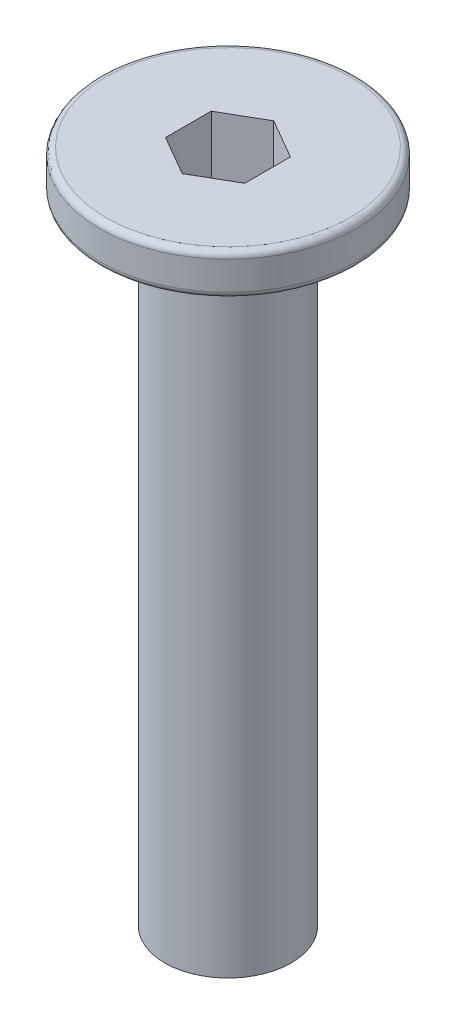
ISO-10303-21;
HEADER;
FILE_DESCRIPTION(('STEP AP214'),'2;1');
FILE_NAME('part.step','',(''),(''),'','','');
FILE_SCHEMA(('AUTOMOTIVE_DESIGN { 1 0 10303 214 1 1 1 1 }'));
ENDSEC;
DATA;
#1=APPLICATION_CONTEXT('core data for automotive mechanical design processes');
#2=APPLICATION_PROTOCOL_DEFINITION('international standard','automotive_design',2000,#1);
#3=PRODUCT_CONTEXT('',#1,'mechanical');
#4=PRODUCT('Part','Part','',(#3));
#5=PRODUCT_RELATED_PRODUCT_CATEGORY('part','',(#4));
#6=PRODUCT_DEFINITION_FORMATION('','',#4);
#7=PRODUCT_DEFINITION_CONTEXT('part definition',#1,'design');
#8=PRODUCT_DEFINITION('design','',#6,#7);
#9=PRODUCT_DEFINITION_SHAPE('','',#8);
#10=(LENGTH_UNIT() NAMED_UNIT(*) SI_UNIT(.MILLI.,.METRE.));
#11=(NAMED_UNIT(*) PLANE_ANGLE_UNIT() SI_UNIT($,.RADIAN.));
#12=(NAMED_UNIT(*) SI_UNIT($,.STERADIAN.) SOLID_ANGLE_UNIT());
#13=UNCERTAINTY_MEASURE_WITH_UNIT(LENGTH_MEASURE(1.E-05),#10,'distance_accuracy_value','');
#14=(GEOMETRIC_REPRESENTATION_CONTEXT(3) GLOBAL_UNCERTAINTY_ASSIGNED_CONTEXT((#13)) GLOBAL_UNIT_ASSIGNED_CONTEXT((#10,
#11,#12)) REPRESENTATION_CONTEXT('',''));
#15=CARTESIAN_POINT('',(0.,0.,0.));
#16=DIRECTION('',(0.,0.,1.));
#17=DIRECTION('',(1.,0.,0.));
#18=AXIS2_PLACEMENT_3D('',#15,#16,#17);
#19=CARTESIAN_POINT('',(0.,1.3,0.));
#20=DIRECTION('',(0.,-1.,0.));
#21=DIRECTION('',(0.,0.,-1.));
#22=AXIS2_PLACEMENT_3D('',#19,#20,#21);
#23=CYLINDRICAL_SURFACE('',#22,4.05);
#24=CARTESIAN_POINT('',(0.,0.2,0.));
#25=DIRECTION('',(0.,1.,0.));
#26=DIRECTION('',(0.,0.,1.));
#27=AXIS2_PLACEMENT_3D('',#24,#25,#26);
#28=CIRCLE('',#27,4.05);
#29=CARTESIAN_POINT('',(0.,0.2,4.05));
#30=VERTEX_POINT('',#29);
#31=EDGE_CURVE('E146',#30,#30,#28,.T.);
#32=ORIENTED_EDGE('',*,*,#31,.T.);
#33=EDGE_LOOP('',(#32));
#34=FACE_BOUND('',#33,.T.);
#35=CARTESIAN_POINT('',(0.,1.1,0.));
#36=DIRECTION('',(0.,1.,0.));
#37=DIRECTION('',(0.,0.,1.));
#38=AXIS2_PLACEMENT_3D('',#35,#36,#37);
#39=CIRCLE('',#38,4.05);
#40=CARTESIAN_POINT('',(0.,1.1,4.05));
#41=VERTEX_POINT('',#40);
#42=EDGE_CURVE('E143',#41,#41,#39,.F.);
#43=ORIENTED_EDGE('',*,*,#42,.T.);
#44=EDGE_LOOP('',(#43));
#45=FACE_BOUND('',#44,.T.);
#46=ADVANCED_FACE('F33',(#34,#45),#23,.T.);
#47=CARTESIAN_POINT('',(0.,1.3,0.));
#48=DIRECTION('',(0.,1.,0.));
#49=DIRECTION('',(0.,0.,1.));
#50=AXIS2_PLACEMENT_3D('',#47,#48,#49);
#51=PLANE('',#50);
#52=DIRECTION('',(0.,0.,1.));
#53=VECTOR('',#52,1.);
#54=CARTESIAN_POINT('',(-1.25,1.3,-0.721687836487032));
#55=LINE('',#54,#53);
#56=CARTESIAN_POINT('',(-1.25,1.3,-0.721687836487032));
#57=VERTEX_POINT('',#56);
#58=CARTESIAN_POINT('',(-1.25,1.3,0.721687836487032));
#59=VERTEX_POINT('',#58);
#60=EDGE_CURVE('E48',#57,#59,#55,.T.);
#61=ORIENTED_EDGE('',*,*,#60,.F.);
#62=DIRECTION('',(-0.866025403784438,0.,0.5));
#63=VECTOR('',#62,1.);
#64=CARTESIAN_POINT('',(0.,1.3,-1.44337567297406));
#65=LINE('',#64,#63);
#66=CARTESIAN_POINT('',(0.,1.3,-1.44337567297406));
#67=VERTEX_POINT('',#66);
#68=EDGE_CURVE('E131',#67,#57,#65,.T.);
#69=ORIENTED_EDGE('',*,*,#68,.F.);
#70=DIRECTION('',(-0.866025403784439,0.,-0.5));
#71=VECTOR('',#70,1.);
#72=CARTESIAN_POINT('',(1.25,1.3,-0.721687836487032));
#73=LINE('',#72,#71);
#74=CARTESIAN_POINT('',(1.25,1.3,-0.721687836487032));
#75=VERTEX_POINT('',#74);
#76=EDGE_CURVE('E129',#75,#67,#73,.T.);
#77=ORIENTED_EDGE('',*,*,#76,.F.);
#78=DIRECTION('',(0.,0.,-1.));
#79=VECTOR('',#78,1.);
#80=CARTESIAN_POINT('',(1.25,1.3,0.721687836487032));
#81=LINE('',#80,#79);
#82=CARTESIAN_POINT('',(1.25,1.3,0.721687836487032));
#83=VERTEX_POINT('',#82);
#84=EDGE_CURVE('E96',#83,#75,#81,.T.);
#85=ORIENTED_EDGE('',*,*,#84,.F.);
#86=DIRECTION('',(0.866025403784438,0.,-0.5));
#87=VECTOR('',#86,1.);
#88=CARTESIAN_POINT('',(0.,1.3,1.44337567297406));
#89=LINE('',#88,#87);
#90=CARTESIAN_POINT('',(0.,1.3,1.44337567297406));
#91=VERTEX_POINT('',#90);
#92=EDGE_CURVE('E125',#91,#83,#89,.T.);
#93=ORIENTED_EDGE('',*,*,#92,.F.);
#94=DIRECTION('',(0.866025403784439,0.,0.5));
#95=VECTOR('',#94,1.);
#96=CARTESIAN_POINT('',(-1.25,1.3,0.721687836487032));
#97=LINE('',#96,#95);
#98=EDGE_CURVE('E122',#59,#91,#97,.T.);
#99=ORIENTED_EDGE('',*,*,#98,.F.);
#100=EDGE_LOOP('',(#61,#69,#77,#85,#93,#99));
#101=FACE_BOUND('',#100,.T.);
#102=CARTESIAN_POINT('',(0.,1.3,0.));
#103=DIRECTION('',(0.,1.,0.));
#104=DIRECTION('',(0.,0.,1.));
#105=AXIS2_PLACEMENT_3D('',#102,#103,#104);
#106=CIRCLE('',#105,3.85);
#107=CARTESIAN_POINT('',(0.,1.3,3.85));
#108=VERTEX_POINT('',#107);
#109=EDGE_CURVE('E41',#108,#108,#106,.T.);
#110=ORIENTED_EDGE('',*,*,#109,.T.);
#111=EDGE_LOOP('',(#110));
#112=FACE_BOUND('',#111,.T.);
#113=ADVANCED_FACE('F154',(#101,#112),#51,.T.);
#114=CARTESIAN_POINT('',(0.,0.,0.));
#115=DIRECTION('',(0.,1.,0.));
#116=DIRECTION('',(0.,0.,1.));
#117=AXIS2_PLACEMENT_3D('',#114,#115,#116);
#118=PLANE('',#117);
#119=CARTESIAN_POINT('',(0.,0.,0.));
#120=DIRECTION('',(0.,1.,0.));
#121=DIRECTION('',(0.,0.,1.));
#122=AXIS2_PLACEMENT_3D('',#119,#120,#121);
#123=CIRCLE('',#122,2.);
#124=CARTESIAN_POINT('',(0.,0.,2.));
#125=VERTEX_POINT('',#124);
#126=EDGE_CURVE('E11',#125,#125,#123,.F.);
#127=ORIENTED_EDGE('',*,*,#126,.F.);
#128=EDGE_LOOP('',(#127));
#129=FACE_BOUND('',#128,.T.);
#130=CARTESIAN_POINT('',(0.,0.,0.));
#131=DIRECTION('',(0.,1.,0.));
#132=DIRECTION('',(0.,0.,1.));
#133=AXIS2_PLACEMENT_3D('',#130,#131,#132);
#134=CIRCLE('',#133,3.85);
#135=CARTESIAN_POINT('',(0.,0.,3.85));
#136=VERTEX_POINT('',#135);
#137=EDGE_CURVE('E149',#136,#136,#134,.F.);
#138=ORIENTED_EDGE('',*,*,#137,.T.);
#139=EDGE_LOOP('',(#138));
#140=FACE_BOUND('',#139,.T.);
#141=ADVANCED_FACE('F167',(#129,#140),#118,.F.);
#142=CARTESIAN_POINT('',(0.,0.2,0.));
#143=DIRECTION('',(0.,1.,0.));
#144=DIRECTION('',(0.,0.,1.));
#145=AXIS2_PLACEMENT_3D('',#142,#143,#144);
#146=TOROIDAL_SURFACE('',#145,3.85,0.2);
#147=ORIENTED_EDGE('',*,*,#137,.F.);
#148=EDGE_LOOP('',(#147));
#149=FACE_BOUND('',#148,.T.);
#150=ORIENTED_EDGE('',*,*,#31,.F.);
#151=EDGE_LOOP('',(#150));
#152=FACE_BOUND('',#151,.T.);
#153=ADVANCED_FACE('F158',(#149,#152),#146,.T.);
#154=CARTESIAN_POINT('',(0.,1.1,0.));
#155=DIRECTION('',(0.,1.,0.));
#156=DIRECTION('',(0.,0.,1.));
#157=AXIS2_PLACEMENT_3D('',#154,#155,#156);
#158=TOROIDAL_SURFACE('',#157,3.85,0.2);
#159=ORIENTED_EDGE('',*,*,#42,.F.);
#160=EDGE_LOOP('',(#159));
#161=FACE_BOUND('',#160,.T.);
#162=ORIENTED_EDGE('',*,*,#109,.F.);
#163=EDGE_LOOP('',(#162));
#164=FACE_BOUND('',#163,.T.);
#165=ADVANCED_FACE('F35',(#161,#164),#158,.T.);
#166=CARTESIAN_POINT('',(0.,-20.,0.));
#167=DIRECTION('',(0.,1.,0.));
#168=DIRECTION('',(0.,0.,1.));
#169=AXIS2_PLACEMENT_3D('',#166,#167,#168);
#170=CYLINDRICAL_SURFACE('',#169,2.);
#171=CARTESIAN_POINT('',(0.,-20.,0.));
#172=DIRECTION('',(0.,-1.,0.));
#173=DIRECTION('',(0.,0.,-1.));
#174=AXIS2_PLACEMENT_3D('',#171,#172,#173);
#175=CIRCLE('',#174,2.);
#176=CARTESIAN_POINT('',(0.,-20.,-2.));
#177=VERTEX_POINT('',#176);
#178=EDGE_CURVE('E135',#177,#177,#175,.T.);
#179=ORIENTED_EDGE('',*,*,#178,.F.);
#180=EDGE_LOOP('',(#179));
#181=FACE_BOUND('',#180,.T.);
#182=ORIENTED_EDGE('',*,*,#126,.T.);
#183=EDGE_LOOP('',(#182));
#184=FACE_BOUND('',#183,.T.);
#185=ADVANCED_FACE('F157',(#181,#184),#170,.T.);
#186=CARTESIAN_POINT('',(0.,-20.,0.));
#187=DIRECTION('',(0.,-1.,0.));
#188=DIRECTION('',(0.,0.,-1.));
#189=AXIS2_PLACEMENT_3D('',#186,#187,#188);
#190=PLANE('',#189);
#191=ORIENTED_EDGE('',*,*,#178,.T.);
#192=EDGE_LOOP('',(#191));
#193=FACE_BOUND('',#192,.T.);
#194=ADVANCED_FACE('F164',(#193),#190,.T.);
#195=CARTESIAN_POINT('',(-1.25,-0.7,-0.721687836487032));
#196=DIRECTION('',(-1.,0.,0.));
#197=DIRECTION('',(0.,0.,1.));
#198=AXIS2_PLACEMENT_3D('',#195,#196,#197);
#199=PLANE('',#198);
#200=ORIENTED_EDGE('',*,*,#60,.T.);
#201=DIRECTION('',(0.,1.,0.));
#202=VECTOR('',#201,1.);
#203=CARTESIAN_POINT('',(-1.25,-0.7,0.721687836487032));
#204=LINE('',#203,#202);
#205=CARTESIAN_POINT('',(-1.25,-0.7,0.721687836487032));
#206=VERTEX_POINT('',#205);
#207=EDGE_CURVE('E78',#206,#59,#204,.T.);
#208=ORIENTED_EDGE('',*,*,#207,.F.);
#209=DIRECTION('',(0.,0.,1.));
#210=VECTOR('',#209,1.);
#211=CARTESIAN_POINT('',(-1.25,-0.7,-0.721687836487032));
#212=LINE('',#211,#210);
#213=CARTESIAN_POINT('',(-1.25,-0.7,-0.721687836487032));
#214=VERTEX_POINT('',#213);
#215=EDGE_CURVE('E133',#214,#206,#212,.T.);
#216=ORIENTED_EDGE('',*,*,#215,.F.);
#217=DIRECTION('',(0.,1.,0.));
#218=VECTOR('',#217,1.);
#219=CARTESIAN_POINT('',(-1.25,-0.7,-0.721687836487032));
#220=LINE('',#219,#218);
#221=EDGE_CURVE('E56',#214,#57,#220,.T.);
#222=ORIENTED_EDGE('',*,*,#221,.T.);
#223=EDGE_LOOP('',(#200,#208,#216,#222));
#224=FACE_BOUND('',#223,.T.);
#225=ADVANCED_FACE('F185',(#224),#199,.F.);
#226=CARTESIAN_POINT('',(0.,-0.7,-1.44337567297406));
#227=DIRECTION('',(-0.5,0.,-0.866025403784438));
#228=DIRECTION('',(-0.866025403784439,0.,0.5));
#229=AXIS2_PLACEMENT_3D('',#226,#227,#228);
#230=PLANE('',#229);
#231=ORIENTED_EDGE('',*,*,#68,.T.);
#232=ORIENTED_EDGE('',*,*,#221,.F.);
#233=DIRECTION('',(-0.866025403784438,0.,0.5));
#234=VECTOR('',#233,1.);
#235=CARTESIAN_POINT('',(0.,-0.7,-1.44337567297406));
#236=LINE('',#235,#234);
#237=CARTESIAN_POINT('',(0.,-0.7,-1.44337567297406));
#238=VERTEX_POINT('',#237);
#239=EDGE_CURVE('E108',#238,#214,#236,.T.);
#240=ORIENTED_EDGE('',*,*,#239,.F.);
#241=DIRECTION('',(0.,1.,0.));
#242=VECTOR('',#241,1.);
#243=CARTESIAN_POINT('',(0.,-0.7,-1.44337567297406));
#244=LINE('',#243,#242);
#245=EDGE_CURVE('E100',#238,#67,#244,.T.);
#246=ORIENTED_EDGE('',*,*,#245,.T.);
#247=EDGE_LOOP('',(#231,#232,#240,#246));
#248=FACE_BOUND('',#247,.T.);
#249=ADVANCED_FACE('F189',(#248),#230,.F.);
#250=CARTESIAN_POINT('',(1.25,-0.7,-0.721687836487032));
#251=DIRECTION('',(0.5,0.,-0.866025403784439));
#252=DIRECTION('',(-0.866025403784439,0.,-0.5));
#253=AXIS2_PLACEMENT_3D('',#250,#251,#252);
#254=PLANE('',#253);
#255=ORIENTED_EDGE('',*,*,#76,.T.);
#256=ORIENTED_EDGE('',*,*,#245,.F.);
#257=DIRECTION('',(-0.866025403784439,0.,-0.5));
#258=VECTOR('',#257,1.);
#259=CARTESIAN_POINT('',(1.25,-0.7,-0.721687836487032));
#260=LINE('',#259,#258);
#261=CARTESIAN_POINT('',(1.25,-0.7,-0.721687836487032));
#262=VERTEX_POINT('',#261);
#263=EDGE_CURVE('E104',#262,#238,#260,.T.);
#264=ORIENTED_EDGE('',*,*,#263,.F.);
#265=DIRECTION('',(0.,1.,0.));
#266=VECTOR('',#265,1.);
#267=CARTESIAN_POINT('',(1.25,-0.7,-0.721687836487032));
#268=LINE('',#267,#266);
#269=EDGE_CURVE('E89',#262,#75,#268,.T.);
#270=ORIENTED_EDGE('',*,*,#269,.T.);
#271=EDGE_LOOP('',(#255,#256,#264,#270));
#272=FACE_BOUND('',#271,.T.);
#273=ADVANCED_FACE('F105',(#272),#254,.F.);
#274=CARTESIAN_POINT('',(1.25,-0.7,0.721687836487032));
#275=DIRECTION('',(1.,0.,0.));
#276=DIRECTION('',(0.,0.,-1.));
#277=AXIS2_PLACEMENT_3D('',#274,#275,#276);
#278=PLANE('',#277);
#279=ORIENTED_EDGE('',*,*,#84,.T.);
#280=ORIENTED_EDGE('',*,*,#269,.F.);
#281=DIRECTION('',(0.,0.,-1.));
#282=VECTOR('',#281,1.);
#283=CARTESIAN_POINT('',(1.25,-0.7,0.721687836487032));
#284=LINE('',#283,#282);
#285=CARTESIAN_POINT('',(1.25,-0.7,0.721687836487032));
#286=VERTEX_POINT('',#285);
#287=EDGE_CURVE('E93',#286,#262,#284,.T.);
#288=ORIENTED_EDGE('',*,*,#287,.F.);
#289=DIRECTION('',(0.,1.,0.));
#290=VECTOR('',#289,1.);
#291=CARTESIAN_POINT('',(1.25,-0.7,0.721687836487032));
#292=LINE('',#291,#290);
#293=EDGE_CURVE('E101',#286,#83,#292,.T.);
#294=ORIENTED_EDGE('',*,*,#293,.T.);
#295=EDGE_LOOP('',(#279,#280,#288,#294));
#296=FACE_BOUND('',#295,.T.);
#297=ADVANCED_FACE('F91',(#296),#278,.F.);
#298=CARTESIAN_POINT('',(0.,-0.7,1.44337567297406));
#299=DIRECTION('',(0.5,0.,0.866025403784438));
#300=DIRECTION('',(0.866025403784439,0.,-0.5));
#301=AXIS2_PLACEMENT_3D('',#298,#299,#300);
#302=PLANE('',#301);
#303=ORIENTED_EDGE('',*,*,#92,.T.);
#304=ORIENTED_EDGE('',*,*,#293,.F.);
#305=DIRECTION('',(0.866025403784438,0.,-0.5));
#306=VECTOR('',#305,1.);
#307=CARTESIAN_POINT('',(0.,-0.7,1.44337567297406));
#308=LINE('',#307,#306);
#309=CARTESIAN_POINT('',(0.,-0.7,1.44337567297406));
#310=VERTEX_POINT('',#309);
#311=EDGE_CURVE('E114',#310,#286,#308,.T.);
#312=ORIENTED_EDGE('',*,*,#311,.F.);
#313=DIRECTION('',(0.,1.,0.));
#314=VECTOR('',#313,1.);
#315=CARTESIAN_POINT('',(0.,-0.7,1.44337567297406));
#316=LINE('',#315,#314);
#317=EDGE_CURVE('E138',#310,#91,#316,.T.);
#318=ORIENTED_EDGE('',*,*,#317,.T.);
#319=EDGE_LOOP('',(#303,#304,#312,#318));
#320=FACE_BOUND('',#319,.T.);
#321=ADVANCED_FACE('F193',(#320),#302,.F.);
#322=CARTESIAN_POINT('',(-1.25,-0.7,0.721687836487032));
#323=DIRECTION('',(-0.5,0.,0.866025403784439));
#324=DIRECTION('',(0.866025403784439,0.,0.5));
#325=AXIS2_PLACEMENT_3D('',#322,#323,#324);
#326=PLANE('',#325);
#327=ORIENTED_EDGE('',*,*,#98,.T.);
#328=ORIENTED_EDGE('',*,*,#317,.F.);
#329=DIRECTION('',(0.866025403784439,0.,0.5));
#330=VECTOR('',#329,1.);
#331=CARTESIAN_POINT('',(-1.25,-0.7,0.721687836487032));
#332=LINE('',#331,#330);
#333=EDGE_CURVE('E116',#206,#310,#332,.T.);
#334=ORIENTED_EDGE('',*,*,#333,.F.);
#335=ORIENTED_EDGE('',*,*,#207,.T.);
#336=EDGE_LOOP('',(#327,#328,#334,#335));
#337=FACE_BOUND('',#336,.T.);
#338=ADVANCED_FACE('F190',(#337),#326,.F.);
#339=CARTESIAN_POINT('',(0.,-0.7,0.));
#340=DIRECTION('',(0.,1.,0.));
#341=DIRECTION('',(0.,0.,1.));
#342=AXIS2_PLACEMENT_3D('',#339,#340,#341);
#343=PLANE('',#342);
#344=ORIENTED_EDGE('',*,*,#215,.T.);
#345=ORIENTED_EDGE('',*,*,#333,.T.);
#346=ORIENTED_EDGE('',*,*,#311,.T.);
#347=ORIENTED_EDGE('',*,*,#287,.T.);
#348=ORIENTED_EDGE('',*,*,#263,.T.);
#349=ORIENTED_EDGE('',*,*,#239,.T.);
#350=EDGE_LOOP('',(#344,#345,#346,#347,#348,#349));
#351=FACE_BOUND('',#350,.T.);
#352=ADVANCED_FACE('F111',(#351),#343,.T.);
#353=CLOSED_SHELL('',(#46,#113,#141,#153,#165,#185,#194,#225,#249,#273,#297,#321,#338,#352));
#354=MANIFOLD_SOLID_BREP('B2',#353);
#355=ADVANCED_BREP_SHAPE_REPRESENTATION('',(#18,#354),#14);
#356=SHAPE_DEFINITION_REPRESENTATION(#9,#355);
ENDSEC;
END-ISO-10303-21;
